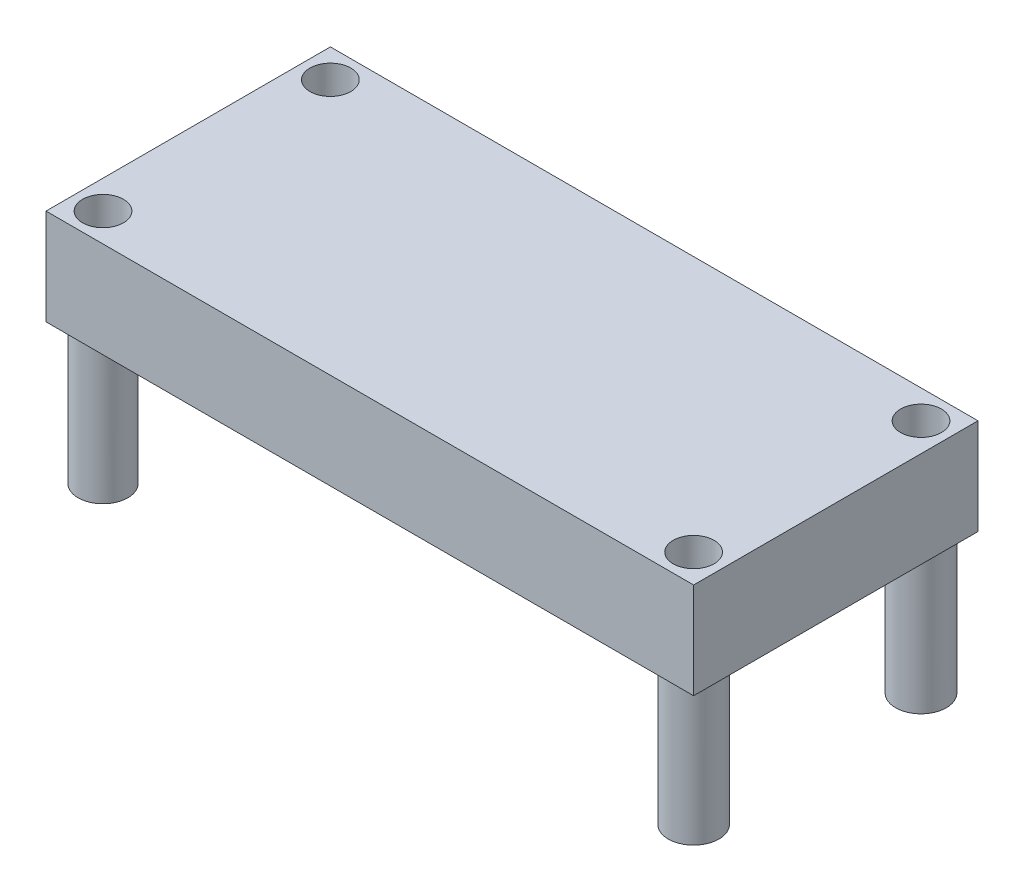
ISO-10303-21;
HEADER;
FILE_DESCRIPTION(('STEP AP214'),'2;1');
FILE_NAME('part.step','',(''),(''),'','','');
FILE_SCHEMA(('AUTOMOTIVE_DESIGN { 1 0 10303 214 1 1 1 1 }'));
ENDSEC;
DATA;
#1=APPLICATION_CONTEXT('core data for automotive mechanical design processes');
#2=APPLICATION_PROTOCOL_DEFINITION('international standard','automotive_design',2000,#1);
#3=PRODUCT_CONTEXT('',#1,'mechanical');
#4=PRODUCT('Part','Part','',(#3));
#5=PRODUCT_RELATED_PRODUCT_CATEGORY('part','',(#4));
#6=PRODUCT_DEFINITION_FORMATION('','',#4);
#7=PRODUCT_DEFINITION_CONTEXT('part definition',#1,'design');
#8=PRODUCT_DEFINITION('design','',#6,#7);
#9=PRODUCT_DEFINITION_SHAPE('','',#8);
#10=(LENGTH_UNIT() NAMED_UNIT(*) SI_UNIT(.MILLI.,.METRE.));
#11=(NAMED_UNIT(*) PLANE_ANGLE_UNIT() SI_UNIT($,.RADIAN.));
#12=(NAMED_UNIT(*) SI_UNIT($,.STERADIAN.) SOLID_ANGLE_UNIT());
#13=UNCERTAINTY_MEASURE_WITH_UNIT(LENGTH_MEASURE(1.E-05),#10,'distance_accuracy_value','');
#14=(GEOMETRIC_REPRESENTATION_CONTEXT(3) GLOBAL_UNCERTAINTY_ASSIGNED_CONTEXT((#13)) GLOBAL_UNIT_ASSIGNED_CONTEXT((#10,
#11,#12)) REPRESENTATION_CONTEXT('',''));
#15=CARTESIAN_POINT('',(0.,0.,0.));
#16=DIRECTION('',(0.,0.,1.));
#17=DIRECTION('',(1.,0.,0.));
#18=AXIS2_PLACEMENT_3D('',#15,#16,#17);
#19=CARTESIAN_POINT('',(-16.8639448621554,7.6962,-11.4760573934837));
#20=DIRECTION('',(1.,0.,0.));
#21=DIRECTION('',(0.,0.,-1.));
#22=AXIS2_PLACEMENT_3D('',#19,#20,#21);
#23=PLANE('',#22);
#24=DIRECTION('',(0.,0.,1.));
#25=VECTOR('',#24,1.);
#26=CARTESIAN_POINT('',(-16.8639448621554,0.,-11.4760573934837));
#27=LINE('',#26,#25);
#28=CARTESIAN_POINT('',(-16.8639448621554,0.,-11.4760573934837));
#29=VERTEX_POINT('',#28);
#30=CARTESIAN_POINT('',(-16.8639448621554,0.,11.3331426065163));
#31=VERTEX_POINT('',#30);
#32=EDGE_CURVE('E103',#29,#31,#27,.T.);
#33=ORIENTED_EDGE('',*,*,#32,.T.);
#34=DIRECTION('',(0.,-1.,0.));
#35=VECTOR('',#34,1.);
#36=CARTESIAN_POINT('',(-16.8639448621554,7.6962,11.3331426065163));
#37=LINE('',#36,#35);
#38=CARTESIAN_POINT('',(-16.8639448621554,7.6962,11.3331426065163));
#39=VERTEX_POINT('',#38);
#40=EDGE_CURVE('E94',#39,#31,#37,.T.);
#41=ORIENTED_EDGE('',*,*,#40,.F.);
#42=DIRECTION('',(0.,0.,1.));
#43=VECTOR('',#42,1.);
#44=CARTESIAN_POINT('',(-16.8639448621554,7.6962,-11.4760573934837));
#45=LINE('',#44,#43);
#46=CARTESIAN_POINT('',(-16.8639448621554,7.6962,-11.4760573934837));
#47=VERTEX_POINT('',#46);
#48=EDGE_CURVE('E88',#47,#39,#45,.T.);
#49=ORIENTED_EDGE('',*,*,#48,.F.);
#50=DIRECTION('',(0.,-1.,0.));
#51=VECTOR('',#50,1.);
#52=CARTESIAN_POINT('',(-16.8639448621554,7.6962,-11.4760573934837));
#53=LINE('',#52,#51);
#54=EDGE_CURVE('E99',#47,#29,#53,.T.);
#55=ORIENTED_EDGE('',*,*,#54,.T.);
#56=EDGE_LOOP('',(#33,#41,#49,#55));
#57=FACE_BOUND('',#56,.T.);
#58=ADVANCED_FACE('F36',(#57),#23,.F.);
#59=CARTESIAN_POINT('',(-16.8639448621554,7.6962,11.3331426065163));
#60=DIRECTION('',(0.,0.,-1.));
#61=DIRECTION('',(-1.,0.,0.));
#62=AXIS2_PLACEMENT_3D('',#59,#60,#61);
#63=PLANE('',#62);
#64=DIRECTION('',(1.,0.,0.));
#65=VECTOR('',#64,1.);
#66=CARTESIAN_POINT('',(-16.8639448621554,0.,11.3331426065163));
#67=LINE('',#66,#65);
#68=CARTESIAN_POINT('',(35.0790551378446,0.,11.3331426065163));
#69=VERTEX_POINT('',#68);
#70=EDGE_CURVE('E93',#31,#69,#67,.T.);
#71=ORIENTED_EDGE('',*,*,#70,.T.);
#72=DIRECTION('',(0.,-1.,0.));
#73=VECTOR('',#72,1.);
#74=CARTESIAN_POINT('',(35.0790551378446,7.6962,11.3331426065163));
#75=LINE('',#74,#73);
#76=CARTESIAN_POINT('',(35.0790551378446,7.6962,11.3331426065163));
#77=VERTEX_POINT('',#76);
#78=EDGE_CURVE('E91',#77,#69,#75,.T.);
#79=ORIENTED_EDGE('',*,*,#78,.F.);
#80=DIRECTION('',(1.,0.,0.));
#81=VECTOR('',#80,1.);
#82=CARTESIAN_POINT('',(-16.8639448621554,7.6962,11.3331426065163));
#83=LINE('',#82,#81);
#84=EDGE_CURVE('E83',#39,#77,#83,.T.);
#85=ORIENTED_EDGE('',*,*,#84,.F.);
#86=ORIENTED_EDGE('',*,*,#40,.T.);
#87=EDGE_LOOP('',(#71,#79,#85,#86));
#88=FACE_BOUND('',#87,.T.);
#89=ADVANCED_FACE('F92',(#88),#63,.F.);
#90=CARTESIAN_POINT('',(35.0790551378446,7.6962,-11.4760573934837));
#91=DIRECTION('',(-1.,0.,0.));
#92=DIRECTION('',(0.,0.,1.));
#93=AXIS2_PLACEMENT_3D('',#90,#91,#92);
#94=PLANE('',#93);
#95=DIRECTION('',(0.,0.,-1.));
#96=VECTOR('',#95,1.);
#97=CARTESIAN_POINT('',(35.0790551378446,0.,-11.4760573934837));
#98=LINE('',#97,#96);
#99=CARTESIAN_POINT('',(35.0790551378446,0.,-11.4760573934837));
#100=VERTEX_POINT('',#99);
#101=EDGE_CURVE('E69',#69,#100,#98,.T.);
#102=ORIENTED_EDGE('',*,*,#101,.T.);
#103=DIRECTION('',(0.,-1.,0.));
#104=VECTOR('',#103,1.);
#105=CARTESIAN_POINT('',(35.0790551378446,7.6962,-11.4760573934837));
#106=LINE('',#105,#104);
#107=CARTESIAN_POINT('',(35.0790551378446,7.6962,-11.4760573934837));
#108=VERTEX_POINT('',#107);
#109=EDGE_CURVE('E95',#108,#100,#106,.T.);
#110=ORIENTED_EDGE('',*,*,#109,.F.);
#111=DIRECTION('',(0.,0.,-1.));
#112=VECTOR('',#111,1.);
#113=CARTESIAN_POINT('',(35.0790551378446,7.6962,-11.4760573934837));
#114=LINE('',#113,#112);
#115=EDGE_CURVE('E86',#77,#108,#114,.T.);
#116=ORIENTED_EDGE('',*,*,#115,.F.);
#117=ORIENTED_EDGE('',*,*,#78,.T.);
#118=EDGE_LOOP('',(#102,#110,#116,#117));
#119=FACE_BOUND('',#118,.T.);
#120=ADVANCED_FACE('F97',(#119),#94,.F.);
#121=CARTESIAN_POINT('',(-16.8639448621554,7.6962,-11.4760573934837));
#122=DIRECTION('',(0.,0.,1.));
#123=DIRECTION('',(1.,0.,0.));
#124=AXIS2_PLACEMENT_3D('',#121,#122,#123);
#125=PLANE('',#124);
#126=DIRECTION('',(-1.,0.,0.));
#127=VECTOR('',#126,1.);
#128=CARTESIAN_POINT('',(-16.8639448621554,0.,-11.4760573934837));
#129=LINE('',#128,#127);
#130=EDGE_CURVE('E75',#100,#29,#129,.T.);
#131=ORIENTED_EDGE('',*,*,#130,.T.);
#132=ORIENTED_EDGE('',*,*,#54,.F.);
#133=DIRECTION('',(-1.,0.,0.));
#134=VECTOR('',#133,1.);
#135=CARTESIAN_POINT('',(-16.8639448621554,7.6962,-11.4760573934837));
#136=LINE('',#135,#134);
#137=EDGE_CURVE('E52',#108,#47,#136,.T.);
#138=ORIENTED_EDGE('',*,*,#137,.F.);
#139=ORIENTED_EDGE('',*,*,#109,.T.);
#140=EDGE_LOOP('',(#131,#132,#138,#139));
#141=FACE_BOUND('',#140,.T.);
#142=ADVANCED_FACE('F135',(#141),#125,.F.);
#143=CARTESIAN_POINT('',(0.,7.6962,0.));
#144=DIRECTION('',(0.,1.,0.));
#145=DIRECTION('',(0.,0.,1.));
#146=AXIS2_PLACEMENT_3D('',#143,#144,#145);
#147=PLANE('',#146);
#148=CARTESIAN_POINT('',(32.7930551378446,7.6962,9.04714260651629));
#149=DIRECTION('',(0.,-1.,0.));
#150=DIRECTION('',(0.,0.,-1.));
#151=AXIS2_PLACEMENT_3D('',#148,#149,#150);
#152=CIRCLE('',#151,1.6383);
#153=CARTESIAN_POINT('',(32.7930551378446,7.6962,7.40884260651629));
#154=VERTEX_POINT('',#153);
#155=EDGE_CURVE('E372',#154,#154,#152,.T.);
#156=ORIENTED_EDGE('',*,*,#155,.T.);
#157=EDGE_LOOP('',(#156));
#158=FACE_BOUND('',#157,.T.);
#159=CARTESIAN_POINT('',(32.7930551378446,7.6962,-9.19005739348371));
#160=DIRECTION('',(0.,-1.,0.));
#161=DIRECTION('',(0.,0.,-1.));
#162=AXIS2_PLACEMENT_3D('',#159,#160,#161);
#163=CIRCLE('',#162,1.6383);
#164=CARTESIAN_POINT('',(32.7930551378446,7.6962,-10.8283573934837));
#165=VERTEX_POINT('',#164);
#166=EDGE_CURVE('E378',#165,#165,#163,.T.);
#167=ORIENTED_EDGE('',*,*,#166,.T.);
#168=EDGE_LOOP('',(#167));
#169=FACE_BOUND('',#168,.T.);
#170=CARTESIAN_POINT('',(-14.5779448621554,7.6962,-9.19005739348371));
#171=DIRECTION('',(0.,-1.,0.));
#172=DIRECTION('',(0.,0.,-1.));
#173=AXIS2_PLACEMENT_3D('',#170,#171,#172);
#174=CIRCLE('',#173,1.6383);
#175=CARTESIAN_POINT('',(-14.5779448621554,7.6962,-10.8283573934837));
#176=VERTEX_POINT('',#175);
#177=EDGE_CURVE('E347',#176,#176,#174,.T.);
#178=ORIENTED_EDGE('',*,*,#177,.T.);
#179=EDGE_LOOP('',(#178));
#180=FACE_BOUND('',#179,.T.);
#181=CARTESIAN_POINT('',(-14.5779448621554,7.6962,9.04714260651629));
#182=DIRECTION('',(0.,-1.,0.));
#183=DIRECTION('',(0.,0.,-1.));
#184=AXIS2_PLACEMENT_3D('',#181,#182,#183);
#185=CIRCLE('',#184,1.6383);
#186=CARTESIAN_POINT('',(-14.5779448621554,7.6962,7.40884260651629));
#187=VERTEX_POINT('',#186);
#188=EDGE_CURVE('E338',#187,#187,#185,.T.);
#189=ORIENTED_EDGE('',*,*,#188,.T.);
#190=EDGE_LOOP('',(#189));
#191=FACE_BOUND('',#190,.T.);
#192=ORIENTED_EDGE('',*,*,#48,.T.);
#193=ORIENTED_EDGE('',*,*,#84,.T.);
#194=ORIENTED_EDGE('',*,*,#115,.T.);
#195=ORIENTED_EDGE('',*,*,#137,.T.);
#196=EDGE_LOOP('',(#192,#193,#194,#195));
#197=FACE_BOUND('',#196,.T.);
#198=ADVANCED_FACE('F84',(#158,#169,#180,#191,#197),#147,.T.);
#199=CARTESIAN_POINT('',(0.,0.,0.));
#200=DIRECTION('',(0.,1.,0.));
#201=DIRECTION('',(0.,0.,1.));
#202=AXIS2_PLACEMENT_3D('',#199,#200,#201);
#203=PLANE('',#202);
#204=CARTESIAN_POINT('',(-14.5779448621554,0.,-9.19005739348371));
#205=DIRECTION('',(0.,1.,0.));
#206=DIRECTION('',(0.,0.,1.));
#207=AXIS2_PLACEMENT_3D('',#204,#205,#206);
#208=CIRCLE('',#207,2.032);
#209=CARTESIAN_POINT('',(-14.5779448621554,0.,-7.15805739348371));
#210=VERTEX_POINT('',#209);
#211=EDGE_CURVE('E11',#210,#210,#208,.F.);
#212=ORIENTED_EDGE('',*,*,#211,.F.);
#213=EDGE_LOOP('',(#212));
#214=FACE_BOUND('',#213,.T.);
#215=CARTESIAN_POINT('',(32.7930551378446,0.,-9.19005739348371));
#216=DIRECTION('',(0.,1.,0.));
#217=DIRECTION('',(0.,0.,1.));
#218=AXIS2_PLACEMENT_3D('',#215,#216,#217);
#219=CIRCLE('',#218,2.032);
#220=CARTESIAN_POINT('',(32.7930551378446,0.,-7.15805739348371));
#221=VERTEX_POINT('',#220);
#222=EDGE_CURVE('E44',#221,#221,#219,.F.);
#223=ORIENTED_EDGE('',*,*,#222,.F.);
#224=EDGE_LOOP('',(#223));
#225=FACE_BOUND('',#224,.T.);
#226=CARTESIAN_POINT('',(32.7930551378446,0.,9.04714260651629));
#227=DIRECTION('',(0.,1.,0.));
#228=DIRECTION('',(0.,0.,1.));
#229=AXIS2_PLACEMENT_3D('',#226,#227,#228);
#230=CIRCLE('',#229,2.032);
#231=CARTESIAN_POINT('',(32.7930551378446,0.,11.0791426065163));
#232=VERTEX_POINT('',#231);
#233=EDGE_CURVE('E116',#232,#232,#230,.F.);
#234=ORIENTED_EDGE('',*,*,#233,.F.);
#235=EDGE_LOOP('',(#234));
#236=FACE_BOUND('',#235,.T.);
#237=CARTESIAN_POINT('',(-14.5779448621554,0.,9.04714260651629));
#238=DIRECTION('',(0.,1.,0.));
#239=DIRECTION('',(0.,0.,1.));
#240=AXIS2_PLACEMENT_3D('',#237,#238,#239);
#241=CIRCLE('',#240,1.9939);
#242=CARTESIAN_POINT('',(-14.5779448621554,0.,11.0410426065163));
#243=VERTEX_POINT('',#242);
#244=EDGE_CURVE('E113',#243,#243,#241,.F.);
#245=ORIENTED_EDGE('',*,*,#244,.F.);
#246=EDGE_LOOP('',(#245));
#247=FACE_BOUND('',#246,.T.);
#248=ORIENTED_EDGE('',*,*,#32,.F.);
#249=ORIENTED_EDGE('',*,*,#130,.F.);
#250=ORIENTED_EDGE('',*,*,#101,.F.);
#251=ORIENTED_EDGE('',*,*,#70,.F.);
#252=EDGE_LOOP('',(#248,#249,#250,#251));
#253=FACE_BOUND('',#252,.T.);
#254=ADVANCED_FACE('F123',(#214,#225,#236,#247,#253),#203,.F.);
#255=CARTESIAN_POINT('',(-14.5779448621554,-11.2268,9.04714260651629));
#256=DIRECTION('',(0.,1.,0.));
#257=DIRECTION('',(0.,0.,1.));
#258=AXIS2_PLACEMENT_3D('',#255,#256,#257);
#259=CYLINDRICAL_SURFACE('',#258,1.9939);
#260=CARTESIAN_POINT('',(-14.5779448621554,-11.2268,9.04714260651629));
#261=DIRECTION('',(0.,-1.,0.));
#262=DIRECTION('',(0.,0.,-1.));
#263=AXIS2_PLACEMENT_3D('',#260,#261,#262);
#264=CIRCLE('',#263,1.9939);
#265=CARTESIAN_POINT('',(-14.5779448621554,-11.2268,7.05324260651629));
#266=VERTEX_POINT('',#265);
#267=EDGE_CURVE('E106',#266,#266,#264,.T.);
#268=ORIENTED_EDGE('',*,*,#267,.F.);
#269=EDGE_LOOP('',(#268));
#270=FACE_BOUND('',#269,.T.);
#271=ORIENTED_EDGE('',*,*,#244,.T.);
#272=EDGE_LOOP('',(#271));
#273=FACE_BOUND('',#272,.T.);
#274=ADVANCED_FACE('F126',(#270,#273),#259,.T.);
#275=CARTESIAN_POINT('',(-14.5779448621554,-11.2268,9.04714260651629));
#276=DIRECTION('',(0.,-1.,0.));
#277=DIRECTION('',(0.,0.,-1.));
#278=AXIS2_PLACEMENT_3D('',#275,#276,#277);
#279=PLANE('',#278);
#280=CARTESIAN_POINT('',(-14.5779448621554,-11.2268,9.04714260651629));
#281=DIRECTION('',(0.,-1.,0.));
#282=DIRECTION('',(0.,0.,-1.));
#283=AXIS2_PLACEMENT_3D('',#280,#281,#282);
#284=CIRCLE('',#283,1.6383);
#285=CARTESIAN_POINT('',(-14.5779448621554,-11.2268,7.40884260651629));
#286=VERTEX_POINT('',#285);
#287=EDGE_CURVE('E341',#286,#286,#284,.T.);
#288=ORIENTED_EDGE('',*,*,#287,.F.);
#289=EDGE_LOOP('',(#288));
#290=FACE_BOUND('',#289,.T.);
#291=ORIENTED_EDGE('',*,*,#267,.T.);
#292=EDGE_LOOP('',(#291));
#293=FACE_BOUND('',#292,.T.);
#294=ADVANCED_FACE('F178',(#290,#293),#279,.T.);
#295=CARTESIAN_POINT('',(32.7930551378446,-11.2268,9.04714260651629));
#296=DIRECTION('',(0.,1.,0.));
#297=DIRECTION('',(0.,0.,1.));
#298=AXIS2_PLACEMENT_3D('',#295,#296,#297);
#299=CYLINDRICAL_SURFACE('',#298,2.032);
#300=CARTESIAN_POINT('',(32.7930551378446,-11.2268,9.04714260651629));
#301=DIRECTION('',(0.,-1.,0.));
#302=DIRECTION('',(0.,0.,-1.));
#303=AXIS2_PLACEMENT_3D('',#300,#301,#302);
#304=CIRCLE('',#303,2.032);
#305=CARTESIAN_POINT('',(32.7930551378446,-11.2268,7.01514260651629));
#306=VERTEX_POINT('',#305);
#307=EDGE_CURVE('E356',#306,#306,#304,.T.);
#308=ORIENTED_EDGE('',*,*,#307,.F.);
#309=EDGE_LOOP('',(#308));
#310=FACE_BOUND('',#309,.T.);
#311=ORIENTED_EDGE('',*,*,#233,.T.);
#312=EDGE_LOOP('',(#311));
#313=FACE_BOUND('',#312,.T.);
#314=ADVANCED_FACE('F187',(#310,#313),#299,.T.);
#315=CARTESIAN_POINT('',(32.7930551378446,-11.2268,9.04714260651629));
#316=DIRECTION('',(0.,-1.,0.));
#317=DIRECTION('',(0.,0.,-1.));
#318=AXIS2_PLACEMENT_3D('',#315,#316,#317);
#319=PLANE('',#318);
#320=CARTESIAN_POINT('',(32.7930551378446,-11.2268,9.04714260651629));
#321=DIRECTION('',(0.,-1.,0.));
#322=DIRECTION('',(0.,0.,-1.));
#323=AXIS2_PLACEMENT_3D('',#320,#321,#322);
#324=CIRCLE('',#323,1.6383);
#325=CARTESIAN_POINT('',(32.7930551378446,-11.2268,7.40884260651629));
#326=VERTEX_POINT('',#325);
#327=EDGE_CURVE('E375',#326,#326,#324,.T.);
#328=ORIENTED_EDGE('',*,*,#327,.F.);
#329=EDGE_LOOP('',(#328));
#330=FACE_BOUND('',#329,.T.);
#331=ORIENTED_EDGE('',*,*,#307,.T.);
#332=EDGE_LOOP('',(#331));
#333=FACE_BOUND('',#332,.T.);
#334=ADVANCED_FACE('F192',(#330,#333),#319,.T.);
#335=CARTESIAN_POINT('',(32.7930551378446,-11.2268,-9.19005739348371));
#336=DIRECTION('',(0.,1.,0.));
#337=DIRECTION('',(0.,0.,1.));
#338=AXIS2_PLACEMENT_3D('',#335,#336,#337);
#339=CYLINDRICAL_SURFACE('',#338,2.032);
#340=CARTESIAN_POINT('',(32.7930551378446,-11.2268,-9.19005739348371));
#341=DIRECTION('',(0.,-1.,0.));
#342=DIRECTION('',(0.,0.,-1.));
#343=AXIS2_PLACEMENT_3D('',#340,#341,#342);
#344=CIRCLE('',#343,2.032);
#345=CARTESIAN_POINT('',(32.7930551378446,-11.2268,-11.2220573934837));
#346=VERTEX_POINT('',#345);
#347=EDGE_CURVE('E353',#346,#346,#344,.T.);
#348=ORIENTED_EDGE('',*,*,#347,.F.);
#349=EDGE_LOOP('',(#348));
#350=FACE_BOUND('',#349,.T.);
#351=ORIENTED_EDGE('',*,*,#222,.T.);
#352=EDGE_LOOP('',(#351));
#353=FACE_BOUND('',#352,.T.);
#354=ADVANCED_FACE('F121',(#350,#353),#339,.T.);
#355=CARTESIAN_POINT('',(32.7930551378446,-11.2268,-9.19005739348371));
#356=DIRECTION('',(0.,-1.,0.));
#357=DIRECTION('',(0.,0.,-1.));
#358=AXIS2_PLACEMENT_3D('',#355,#356,#357);
#359=PLANE('',#358);
#360=CARTESIAN_POINT('',(32.7930551378446,-11.2268,-9.19005739348371));
#361=DIRECTION('',(0.,-1.,0.));
#362=DIRECTION('',(0.,0.,-1.));
#363=AXIS2_PLACEMENT_3D('',#360,#361,#362);
#364=CIRCLE('',#363,1.6383);
#365=CARTESIAN_POINT('',(32.7930551378446,-11.2268,-10.8283573934837));
#366=VERTEX_POINT('',#365);
#367=EDGE_CURVE('E381',#366,#366,#364,.T.);
#368=ORIENTED_EDGE('',*,*,#367,.F.);
#369=EDGE_LOOP('',(#368));
#370=FACE_BOUND('',#369,.T.);
#371=ORIENTED_EDGE('',*,*,#347,.T.);
#372=EDGE_LOOP('',(#371));
#373=FACE_BOUND('',#372,.T.);
#374=ADVANCED_FACE('F205',(#370,#373),#359,.T.);
#375=CARTESIAN_POINT('',(-14.5779448621554,-11.2268,-9.19005739348371));
#376=DIRECTION('',(0.,1.,0.));
#377=DIRECTION('',(0.,0.,1.));
#378=AXIS2_PLACEMENT_3D('',#375,#376,#377);
#379=CYLINDRICAL_SURFACE('',#378,2.032);
#380=CARTESIAN_POINT('',(-14.5779448621554,-11.2268,-9.19005739348371));
#381=DIRECTION('',(0.,-1.,0.));
#382=DIRECTION('',(0.,0.,-1.));
#383=AXIS2_PLACEMENT_3D('',#380,#381,#382);
#384=CIRCLE('',#383,2.032);
#385=CARTESIAN_POINT('',(-14.5779448621554,-11.2268,-11.2220573934837));
#386=VERTEX_POINT('',#385);
#387=EDGE_CURVE('E344',#386,#386,#384,.T.);
#388=ORIENTED_EDGE('',*,*,#387,.F.);
#389=EDGE_LOOP('',(#388));
#390=FACE_BOUND('',#389,.T.);
#391=ORIENTED_EDGE('',*,*,#211,.T.);
#392=EDGE_LOOP('',(#391));
#393=FACE_BOUND('',#392,.T.);
#394=ADVANCED_FACE('F214',(#390,#393),#379,.T.);
#395=CARTESIAN_POINT('',(-14.5779448621554,-11.2268,-9.19005739348371));
#396=DIRECTION('',(0.,-1.,0.));
#397=DIRECTION('',(0.,0.,-1.));
#398=AXIS2_PLACEMENT_3D('',#395,#396,#397);
#399=PLANE('',#398);
#400=CARTESIAN_POINT('',(-14.5779448621554,-11.2268,-9.19005739348371));
#401=DIRECTION('',(0.,-1.,0.));
#402=DIRECTION('',(0.,0.,-1.));
#403=AXIS2_PLACEMENT_3D('',#400,#401,#402);
#404=CIRCLE('',#403,1.6383);
#405=CARTESIAN_POINT('',(-14.5779448621554,-11.2268,-10.8283573934837));
#406=VERTEX_POINT('',#405);
#407=EDGE_CURVE('E342',#406,#406,#404,.T.);
#408=ORIENTED_EDGE('',*,*,#407,.F.);
#409=EDGE_LOOP('',(#408));
#410=FACE_BOUND('',#409,.T.);
#411=ORIENTED_EDGE('',*,*,#387,.T.);
#412=EDGE_LOOP('',(#411));
#413=FACE_BOUND('',#412,.T.);
#414=ADVANCED_FACE('F219',(#410,#413),#399,.T.);
#415=CARTESIAN_POINT('',(-14.5779448621554,7.6962,-9.19005739348371));
#416=DIRECTION('',(0.,-1.,0.));
#417=DIRECTION('',(0.,0.,-1.));
#418=AXIS2_PLACEMENT_3D('',#415,#416,#417);
#419=CYLINDRICAL_SURFACE('',#418,1.6383);
#420=ORIENTED_EDGE('',*,*,#177,.F.);
#421=EDGE_LOOP('',(#420));
#422=FACE_BOUND('',#421,.T.);
#423=ORIENTED_EDGE('',*,*,#407,.T.);
#424=EDGE_LOOP('',(#423));
#425=FACE_BOUND('',#424,.T.);
#426=ADVANCED_FACE('F260',(#422,#425),#419,.F.);
#427=CARTESIAN_POINT('',(32.7930551378446,7.6962,-9.19005739348371));
#428=DIRECTION('',(0.,-1.,0.));
#429=DIRECTION('',(0.,0.,-1.));
#430=AXIS2_PLACEMENT_3D('',#427,#428,#429);
#431=CYLINDRICAL_SURFACE('',#430,1.6383);
#432=ORIENTED_EDGE('',*,*,#166,.F.);
#433=EDGE_LOOP('',(#432));
#434=FACE_BOUND('',#433,.T.);
#435=ORIENTED_EDGE('',*,*,#367,.T.);
#436=EDGE_LOOP('',(#435));
#437=FACE_BOUND('',#436,.T.);
#438=ADVANCED_FACE('F271',(#434,#437),#431,.F.);
#439=CARTESIAN_POINT('',(32.7930551378446,7.6962,9.04714260651629));
#440=DIRECTION('',(0.,-1.,0.));
#441=DIRECTION('',(0.,0.,-1.));
#442=AXIS2_PLACEMENT_3D('',#439,#440,#441);
#443=CYLINDRICAL_SURFACE('',#442,1.6383);
#444=ORIENTED_EDGE('',*,*,#155,.F.);
#445=EDGE_LOOP('',(#444));
#446=FACE_BOUND('',#445,.T.);
#447=ORIENTED_EDGE('',*,*,#327,.T.);
#448=EDGE_LOOP('',(#447));
#449=FACE_BOUND('',#448,.T.);
#450=ADVANCED_FACE('F282',(#446,#449),#443,.F.);
#451=CARTESIAN_POINT('',(-14.5779448621554,7.6962,9.04714260651629));
#452=DIRECTION('',(0.,-1.,0.));
#453=DIRECTION('',(0.,0.,-1.));
#454=AXIS2_PLACEMENT_3D('',#451,#452,#453);
#455=CYLINDRICAL_SURFACE('',#454,1.6383);
#456=ORIENTED_EDGE('',*,*,#188,.F.);
#457=EDGE_LOOP('',(#456));
#458=FACE_BOUND('',#457,.T.);
#459=ORIENTED_EDGE('',*,*,#287,.T.);
#460=EDGE_LOOP('',(#459));
#461=FACE_BOUND('',#460,.T.);
#462=ADVANCED_FACE('F293',(#458,#461),#455,.F.);
#463=CLOSED_SHELL('',(#58,#89,#120,#142,#198,#254,#274,#294,#314,#334,#354,#374,#394,#414,#426,
#438,#450,#462));
#464=MANIFOLD_SOLID_BREP('B2',#463);
#465=ADVANCED_BREP_SHAPE_REPRESENTATION('',(#18,#464),#14);
#466=SHAPE_DEFINITION_REPRESENTATION(#9,#465);
ENDSEC;
END-ISO-10303-21;
